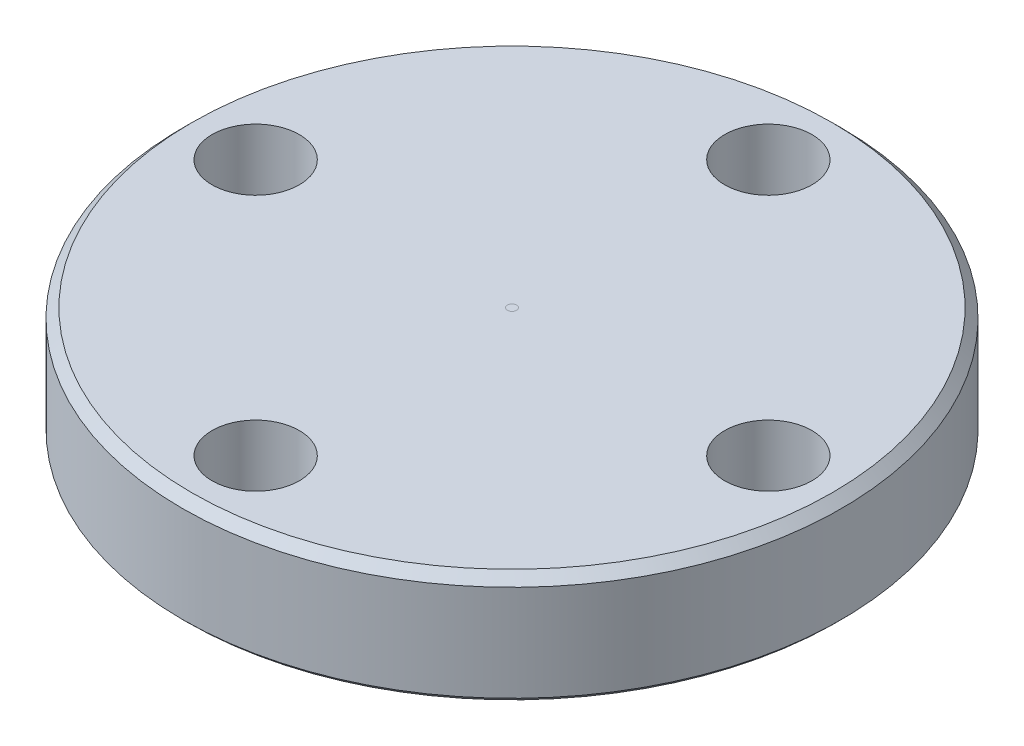
ISO-10303-21;
HEADER;
FILE_DESCRIPTION(('STEP AP214'),'2;1');
FILE_NAME('part.step','',(''),(''),'','','');
FILE_SCHEMA(('AUTOMOTIVE_DESIGN { 1 0 10303 214 1 1 1 1 }'));
ENDSEC;
DATA;
#1=APPLICATION_CONTEXT('core data for automotive mechanical design processes');
#2=APPLICATION_PROTOCOL_DEFINITION('international standard','automotive_design',2000,#1);
#3=PRODUCT_CONTEXT('',#1,'mechanical');
#4=PRODUCT('Part','Part','',(#3));
#5=PRODUCT_RELATED_PRODUCT_CATEGORY('part','',(#4));
#6=PRODUCT_DEFINITION_FORMATION('','',#4);
#7=PRODUCT_DEFINITION_CONTEXT('part definition',#1,'design');
#8=PRODUCT_DEFINITION('design','',#6,#7);
#9=PRODUCT_DEFINITION_SHAPE('','',#8);
#10=(LENGTH_UNIT() NAMED_UNIT(*) SI_UNIT(.MILLI.,.METRE.));
#11=(NAMED_UNIT(*) PLANE_ANGLE_UNIT() SI_UNIT($,.RADIAN.));
#12=(NAMED_UNIT(*) SI_UNIT($,.STERADIAN.) SOLID_ANGLE_UNIT());
#13=UNCERTAINTY_MEASURE_WITH_UNIT(LENGTH_MEASURE(1.E-05),#10,'distance_accuracy_value','');
#14=(GEOMETRIC_REPRESENTATION_CONTEXT(3) GLOBAL_UNCERTAINTY_ASSIGNED_CONTEXT((#13)) GLOBAL_UNIT_ASSIGNED_CONTEXT((#10,
#11,#12)) REPRESENTATION_CONTEXT('',''));
#15=CARTESIAN_POINT('',(0.,0.,0.));
#16=DIRECTION('',(0.,0.,1.));
#17=DIRECTION('',(1.,0.,0.));
#18=AXIS2_PLACEMENT_3D('',#15,#16,#17);
#19=CARTESIAN_POINT('',(0.,12.,0.));
#20=DIRECTION('',(0.,1.,0.));
#21=DIRECTION('',(0.,0.,1.));
#22=AXIS2_PLACEMENT_3D('',#19,#20,#21);
#23=PLANE('',#22);
#24=CARTESIAN_POINT('',(0.,12.,0.));
#25=DIRECTION('',(0.,1.,0.));
#26=DIRECTION('',(0.,0.,1.));
#27=AXIS2_PLACEMENT_3D('',#24,#25,#26);
#28=CIRCLE('',#27,35.);
#29=CARTESIAN_POINT('',(0.,12.,35.));
#30=VERTEX_POINT('',#29);
#31=EDGE_CURVE('P0_E31',#30,#30,#28,.T.);
#32=ORIENTED_EDGE('',*,*,#31,.T.);
#33=EDGE_LOOP('',(#32));
#34=FACE_BOUND('',#33,.T.);
#35=CARTESIAN_POINT('',(28.,12.,0.));
#36=DIRECTION('',(0.,1.,0.));
#37=DIRECTION('',(1.,0.,0.));
#38=AXIS2_PLACEMENT_3D('',#35,#36,#37);
#39=CIRCLE('',#38,4.765);
#40=CARTESIAN_POINT('',(32.765,12.,-1.14398386067195E-13));
#41=VERTEX_POINT('',#40);
#42=EDGE_CURVE('P0_E61',#41,#41,#39,.T.);
#43=ORIENTED_EDGE('',*,*,#42,.F.);
#44=EDGE_LOOP('',(#43));
#45=FACE_BOUND('',#44,.T.);
#46=CARTESIAN_POINT('',(0.,12.,-28.));
#47=DIRECTION('',(0.,1.,0.));
#48=DIRECTION('',(0.,0.,-1.));
#49=AXIS2_PLACEMENT_3D('',#46,#47,#48);
#50=CIRCLE('',#49,4.765);
#51=CARTESIAN_POINT('',(0.,12.,-32.765));
#52=VERTEX_POINT('',#51);
#53=EDGE_CURVE('P0_E55',#52,#52,#50,.T.);
#54=ORIENTED_EDGE('',*,*,#53,.F.);
#55=EDGE_LOOP('',(#54));
#56=FACE_BOUND('',#55,.T.);
#57=CARTESIAN_POINT('',(-28.,12.,2.93284432462823E-13));
#58=DIRECTION('',(0.,1.,0.));
#59=DIRECTION('',(-1.,0.,0.));
#60=AXIS2_PLACEMENT_3D('',#57,#58,#59);
#61=CIRCLE('',#60,4.765);
#62=CARTESIAN_POINT('',(-32.765,12.,3.43195158201586E-13));
#63=VERTEX_POINT('',#62);
#64=EDGE_CURVE('P0_E49',#63,#63,#61,.T.);
#65=ORIENTED_EDGE('',*,*,#64,.F.);
#66=EDGE_LOOP('',(#65));
#67=FACE_BOUND('',#66,.T.);
#68=CARTESIAN_POINT('',(0.,12.,28.));
#69=DIRECTION('',(0.,1.,0.));
#70=DIRECTION('',(0.,0.,1.));
#71=AXIS2_PLACEMENT_3D('',#68,#69,#70);
#72=CIRCLE('',#71,4.765);
#73=CARTESIAN_POINT('',(0.,12.,32.765));
#74=VERTEX_POINT('',#73);
#75=EDGE_CURVE('P0_E43',#74,#74,#72,.T.);
#76=ORIENTED_EDGE('',*,*,#75,.F.);
#77=EDGE_LOOP('',(#76));
#78=FACE_BOUND('',#77,.T.);
#79=CARTESIAN_POINT('',(0.,12.,0.));
#80=DIRECTION('',(0.,1.,0.));
#81=DIRECTION('',(0.,0.,1.));
#82=AXIS2_PLACEMENT_3D('',#79,#80,#81);
#83=CIRCLE('',#82,0.5);
#84=CARTESIAN_POINT('',(0.,12.,0.5));
#85=VERTEX_POINT('',#84);
#86=EDGE_CURVE('P0_E36',#85,#85,#83,.T.);
#87=ORIENTED_EDGE('',*,*,#86,.F.);
#88=EDGE_LOOP('',(#87));
#89=FACE_BOUND('',#88,.T.);
#90=ADVANCED_FACE('P0_F15',(#34,#45,#56,#67,#78,#89),#23,.T.);
#91=CARTESIAN_POINT('',(0.,0.,0.));
#92=DIRECTION('',(0.,1.,0.));
#93=DIRECTION('',(0.,0.,1.));
#94=AXIS2_PLACEMENT_3D('',#91,#92,#93);
#95=PLANE('',#94);
#96=CARTESIAN_POINT('',(0.,0.,0.));
#97=DIRECTION('',(0.,1.,0.));
#98=DIRECTION('',(0.,0.,1.));
#99=AXIS2_PLACEMENT_3D('',#96,#97,#98);
#100=CIRCLE('',#99,35.5);
#101=CARTESIAN_POINT('',(0.,0.,35.5));
#102=VERTEX_POINT('',#101);
#103=EDGE_CURVE('P0_E10',#102,#102,#100,.F.);
#104=ORIENTED_EDGE('',*,*,#103,.T.);
#105=EDGE_LOOP('',(#104));
#106=FACE_BOUND('',#105,.T.);
#107=CARTESIAN_POINT('',(28.,0.,0.));
#108=DIRECTION('',(0.,1.,0.));
#109=DIRECTION('',(1.,0.,0.));
#110=AXIS2_PLACEMENT_3D('',#107,#108,#109);
#111=CIRCLE('',#110,4.765);
#112=CARTESIAN_POINT('',(32.765,0.,-1.14398386067195E-13));
#113=VERTEX_POINT('',#112);
#114=EDGE_CURVE('P0_E46',#113,#113,#111,.T.);
#115=ORIENTED_EDGE('',*,*,#114,.T.);
#116=EDGE_LOOP('',(#115));
#117=FACE_BOUND('',#116,.T.);
#118=CARTESIAN_POINT('',(0.,0.,-28.));
#119=DIRECTION('',(0.,1.,0.));
#120=DIRECTION('',(0.,0.,-1.));
#121=AXIS2_PLACEMENT_3D('',#118,#119,#120);
#122=CIRCLE('',#121,4.765);
#123=CARTESIAN_POINT('',(0.,0.,-32.765));
#124=VERTEX_POINT('',#123);
#125=EDGE_CURVE('P0_E58',#124,#124,#122,.T.);
#126=ORIENTED_EDGE('',*,*,#125,.T.);
#127=EDGE_LOOP('',(#126));
#128=FACE_BOUND('',#127,.T.);
#129=CARTESIAN_POINT('',(-28.,0.,2.93284432462823E-13));
#130=DIRECTION('',(0.,1.,0.));
#131=DIRECTION('',(-1.,0.,0.));
#132=AXIS2_PLACEMENT_3D('',#129,#130,#131);
#133=CIRCLE('',#132,4.765);
#134=CARTESIAN_POINT('',(-32.765,0.,3.43195158201586E-13));
#135=VERTEX_POINT('',#134);
#136=EDGE_CURVE('P0_E52',#135,#135,#133,.T.);
#137=ORIENTED_EDGE('',*,*,#136,.T.);
#138=EDGE_LOOP('',(#137));
#139=FACE_BOUND('',#138,.T.);
#140=CARTESIAN_POINT('',(0.,0.,28.));
#141=DIRECTION('',(0.,1.,0.));
#142=DIRECTION('',(0.,0.,1.));
#143=AXIS2_PLACEMENT_3D('',#140,#141,#142);
#144=CIRCLE('',#143,4.765);
#145=CARTESIAN_POINT('',(0.,0.,32.765));
#146=VERTEX_POINT('',#145);
#147=EDGE_CURVE('P0_E40',#146,#146,#144,.T.);
#148=ORIENTED_EDGE('',*,*,#147,.T.);
#149=EDGE_LOOP('',(#148));
#150=FACE_BOUND('',#149,.T.);
#151=CARTESIAN_POINT('',(0.,0.,0.));
#152=DIRECTION('',(0.,1.,0.));
#153=DIRECTION('',(0.,0.,1.));
#154=AXIS2_PLACEMENT_3D('',#151,#152,#153);
#155=CIRCLE('',#154,0.5);
#156=CARTESIAN_POINT('',(0.,0.,0.5));
#157=VERTEX_POINT('',#156);
#158=EDGE_CURVE('P0_E37',#157,#157,#155,.T.);
#159=ORIENTED_EDGE('',*,*,#158,.T.);
#160=EDGE_LOOP('',(#159));
#161=FACE_BOUND('',#160,.T.);
#162=ADVANCED_FACE('P0_F67',(#106,#117,#128,#139,#150,#161),#95,.F.);
#163=CARTESIAN_POINT('',(0.,12.,0.));
#164=DIRECTION('',(0.,-1.,0.));
#165=DIRECTION('',(0.,0.,-1.));
#166=AXIS2_PLACEMENT_3D('',#163,#164,#165);
#167=CYLINDRICAL_SURFACE('',#166,36.);
#168=CARTESIAN_POINT('',(0.,0.499999999999994,0.));
#169=DIRECTION('',(0.,1.,0.));
#170=DIRECTION('',(0.,0.,1.));
#171=AXIS2_PLACEMENT_3D('',#168,#169,#170);
#172=CIRCLE('',#171,36.);
#173=CARTESIAN_POINT('',(0.,0.499999999999994,36.));
#174=VERTEX_POINT('',#173);
#175=EDGE_CURVE('P0_E23',#174,#174,#172,.T.);
#176=ORIENTED_EDGE('',*,*,#175,.T.);
#177=EDGE_LOOP('',(#176));
#178=FACE_BOUND('',#177,.T.);
#179=CARTESIAN_POINT('',(0.,11.,0.));
#180=DIRECTION('',(0.,1.,0.));
#181=DIRECTION('',(0.,0.,1.));
#182=AXIS2_PLACEMENT_3D('',#179,#180,#181);
#183=CIRCLE('',#182,36.);
#184=CARTESIAN_POINT('',(0.,11.,36.));
#185=VERTEX_POINT('',#184);
#186=EDGE_CURVE('P0_E27',#185,#185,#183,.F.);
#187=ORIENTED_EDGE('',*,*,#186,.T.);
#188=EDGE_LOOP('',(#187));
#189=FACE_BOUND('',#188,.T.);
#190=ADVANCED_FACE('P0_F94',(#178,#189),#167,.T.);
#191=CARTESIAN_POINT('',(0.,12.,0.));
#192=DIRECTION('',(0.,-1.,0.));
#193=DIRECTION('',(0.,0.,-1.));
#194=AXIS2_PLACEMENT_3D('',#191,#192,#193);
#195=CYLINDRICAL_SURFACE('',#194,0.5);
#196=ORIENTED_EDGE('',*,*,#86,.T.);
#197=EDGE_LOOP('',(#196));
#198=FACE_BOUND('',#197,.T.);
#199=ORIENTED_EDGE('',*,*,#158,.F.);
#200=EDGE_LOOP('',(#199));
#201=FACE_BOUND('',#200,.T.);
#202=ADVANCED_FACE('P0_F90',(#198,#201),#195,.F.);
#203=CARTESIAN_POINT('',(0.,0.,28.));
#204=DIRECTION('',(0.,1.,0.));
#205=DIRECTION('',(0.,0.,1.));
#206=AXIS2_PLACEMENT_3D('',#203,#204,#205);
#207=CYLINDRICAL_SURFACE('',#206,4.765);
#208=ORIENTED_EDGE('',*,*,#147,.F.);
#209=EDGE_LOOP('',(#208));
#210=FACE_BOUND('',#209,.T.);
#211=ORIENTED_EDGE('',*,*,#75,.T.);
#212=EDGE_LOOP('',(#211));
#213=FACE_BOUND('',#212,.T.);
#214=ADVANCED_FACE('P0_F93',(#210,#213),#207,.F.);
#215=CARTESIAN_POINT('',(-28.,0.,2.93284432462823E-13));
#216=DIRECTION('',(0.,1.,0.));
#217=DIRECTION('',(0.,0.,1.));
#218=AXIS2_PLACEMENT_3D('',#215,#216,#217);
#219=CYLINDRICAL_SURFACE('',#218,4.765);
#220=ORIENTED_EDGE('',*,*,#136,.F.);
#221=EDGE_LOOP('',(#220));
#222=FACE_BOUND('',#221,.T.);
#223=ORIENTED_EDGE('',*,*,#64,.T.);
#224=EDGE_LOOP('',(#223));
#225=FACE_BOUND('',#224,.T.);
#226=ADVANCED_FACE('P0_F150',(#222,#225),#219,.F.);
#227=CARTESIAN_POINT('',(0.,0.,-28.));
#228=DIRECTION('',(0.,1.,0.));
#229=DIRECTION('',(0.,0.,1.));
#230=AXIS2_PLACEMENT_3D('',#227,#228,#229);
#231=CYLINDRICAL_SURFACE('',#230,4.765);
#232=ORIENTED_EDGE('',*,*,#125,.F.);
#233=EDGE_LOOP('',(#232));
#234=FACE_BOUND('',#233,.T.);
#235=ORIENTED_EDGE('',*,*,#53,.T.);
#236=EDGE_LOOP('',(#235));
#237=FACE_BOUND('',#236,.T.);
#238=ADVANCED_FACE('P0_F74',(#234,#237),#231,.F.);
#239=CARTESIAN_POINT('',(28.,0.,0.));
#240=DIRECTION('',(0.,1.,0.));
#241=DIRECTION('',(0.,0.,1.));
#242=AXIS2_PLACEMENT_3D('',#239,#240,#241);
#243=CYLINDRICAL_SURFACE('',#242,4.765);
#244=ORIENTED_EDGE('',*,*,#114,.F.);
#245=EDGE_LOOP('',(#244));
#246=FACE_BOUND('',#245,.T.);
#247=ORIENTED_EDGE('',*,*,#42,.T.);
#248=EDGE_LOOP('',(#247));
#249=FACE_BOUND('',#248,.T.);
#250=ADVANCED_FACE('P0_F70',(#246,#249),#243,.F.);
#251=CARTESIAN_POINT('',(0.,12.,0.));
#252=DIRECTION('',(0.,-1.,0.));
#253=DIRECTION('',(0.,0.,-1.));
#254=AXIS2_PLACEMENT_3D('',#251,#252,#253);
#255=CONICAL_SURFACE('',#254,35.,0.785398163397441);
#256=ORIENTED_EDGE('',*,*,#186,.F.);
#257=EDGE_LOOP('',(#256));
#258=FACE_BOUND('',#257,.T.);
#259=ORIENTED_EDGE('',*,*,#31,.F.);
#260=EDGE_LOOP('',(#259));
#261=FACE_BOUND('',#260,.T.);
#262=ADVANCED_FACE('P0_F73',(#258,#261),#255,.T.);
#263=CARTESIAN_POINT('',(0.,0.499999999999994,0.));
#264=DIRECTION('',(0.,1.,0.));
#265=DIRECTION('',(0.,0.,1.));
#266=AXIS2_PLACEMENT_3D('',#263,#264,#265);
#267=CONICAL_SURFACE('',#266,36.,0.785398163397448);
#268=ORIENTED_EDGE('',*,*,#103,.F.);
#269=EDGE_LOOP('',(#268));
#270=FACE_BOUND('',#269,.T.);
#271=ORIENTED_EDGE('',*,*,#175,.F.);
#272=EDGE_LOOP('',(#271));
#273=FACE_BOUND('',#272,.T.);
#274=ADVANCED_FACE('P0_F18',(#270,#273),#267,.T.);
#275=CLOSED_SHELL('',(#90,#162,#190,#202,#214,#226,#238,#250,#262,#274));
#276=MANIFOLD_SOLID_BREP('P0_B1',#275);
#277=CARTESIAN_POINT('',(0.,12.,0.));
#278=DIRECTION('',(0.,-1.,0.));
#279=DIRECTION('',(0.,0.,-1.));
#280=AXIS2_PLACEMENT_3D('',#277,#278,#279);
#281=CYLINDRICAL_SURFACE('',#280,0.499735391729039);
#282=CARTESIAN_POINT('',(0.,12.,0.));
#283=DIRECTION('',(0.,1.,0.));
#284=DIRECTION('',(0.,0.,1.));
#285=AXIS2_PLACEMENT_3D('',#282,#283,#284);
#286=CIRCLE('',#285,0.499735391729039);
#287=CARTESIAN_POINT('',(0.,12.,0.499735391729039));
#288=VERTEX_POINT('',#287);
#289=EDGE_CURVE('P1_E10',#288,#288,#286,.T.);
#290=ORIENTED_EDGE('',*,*,#289,.F.);
#291=EDGE_LOOP('',(#290));
#292=FACE_BOUND('',#291,.T.);
#293=CARTESIAN_POINT('',(0.,0.,0.));
#294=DIRECTION('',(0.,1.,0.));
#295=DIRECTION('',(0.,0.,1.));
#296=AXIS2_PLACEMENT_3D('',#293,#294,#295);
#297=CIRCLE('',#296,0.499735391729039);
#298=CARTESIAN_POINT('',(0.,0.,0.499735391729039));
#299=VERTEX_POINT('',#298);
#300=EDGE_CURVE('P1_E18',#299,#299,#297,.T.);
#301=ORIENTED_EDGE('',*,*,#300,.T.);
#302=EDGE_LOOP('',(#301));
#303=FACE_BOUND('',#302,.T.);
#304=ADVANCED_FACE('P1_F15',(#292,#303),#281,.T.);
#305=CARTESIAN_POINT('',(0.,12.,0.));
#306=DIRECTION('',(0.,1.,0.));
#307=DIRECTION('',(0.,0.,1.));
#308=AXIS2_PLACEMENT_3D('',#305,#306,#307);
#309=PLANE('',#308);
#310=ORIENTED_EDGE('',*,*,#289,.T.);
#311=EDGE_LOOP('',(#310));
#312=FACE_BOUND('',#311,.T.);
#313=ADVANCED_FACE('P1_F30',(#312),#309,.T.);
#314=CARTESIAN_POINT('',(0.,0.,0.));
#315=DIRECTION('',(0.,1.,0.));
#316=DIRECTION('',(0.,0.,1.));
#317=AXIS2_PLACEMENT_3D('',#314,#315,#316);
#318=PLANE('',#317);
#319=ORIENTED_EDGE('',*,*,#300,.F.);
#320=EDGE_LOOP('',(#319));
#321=FACE_BOUND('',#320,.T.);
#322=ADVANCED_FACE('P1_F28',(#321),#318,.F.);
#323=CLOSED_SHELL('',(#304,#313,#322));
#324=MANIFOLD_SOLID_BREP('P1_B1',#323);
#325=ADVANCED_BREP_SHAPE_REPRESENTATION('',(#18,#276,#324),#14);
#326=SHAPE_DEFINITION_REPRESENTATION(#9,#325);
ENDSEC;
END-ISO-10303-21;
